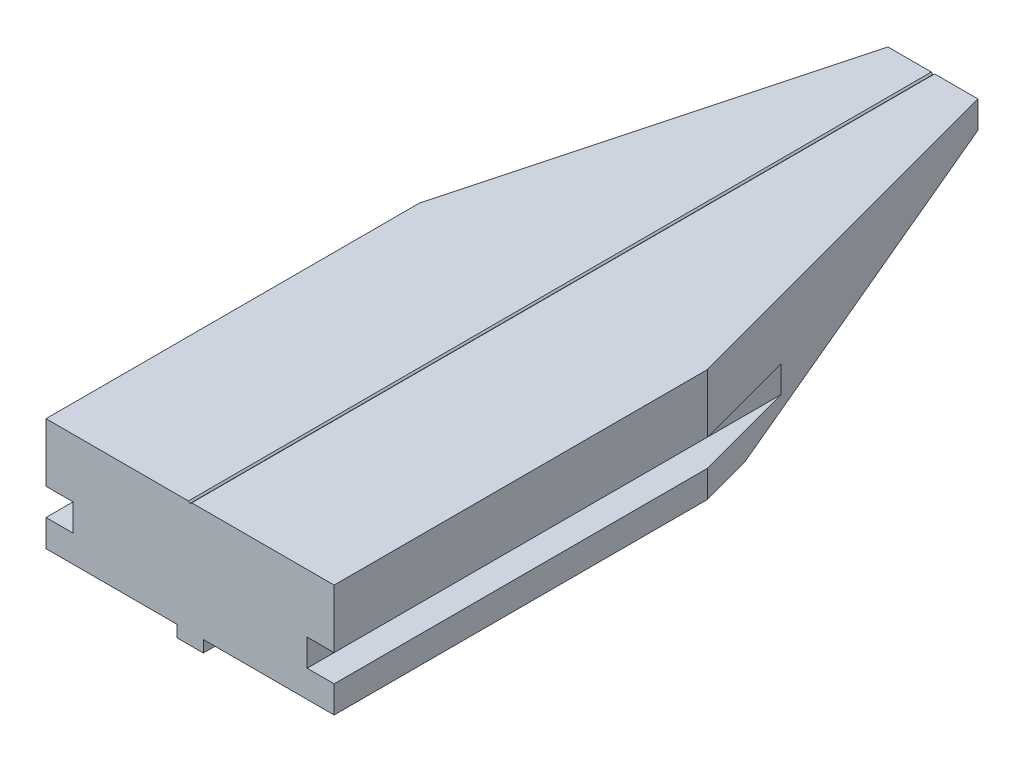
ISO-10303-21;
HEADER;
FILE_DESCRIPTION(('STEP AP214'),'2;1');
FILE_NAME('part.step','',(''),(''),'','','');
FILE_SCHEMA(('AUTOMOTIVE_DESIGN { 1 0 10303 214 1 1 1 1 }'));
ENDSEC;
DATA;
#1=APPLICATION_CONTEXT('core data for automotive mechanical design processes');
#2=APPLICATION_PROTOCOL_DEFINITION('international standard','automotive_design',2000,#1);
#3=PRODUCT_CONTEXT('',#1,'mechanical');
#4=PRODUCT('Part','Part','',(#3));
#5=PRODUCT_RELATED_PRODUCT_CATEGORY('part','',(#4));
#6=PRODUCT_DEFINITION_FORMATION('','',#4);
#7=PRODUCT_DEFINITION_CONTEXT('part definition',#1,'design');
#8=PRODUCT_DEFINITION('design','',#6,#7);
#9=PRODUCT_DEFINITION_SHAPE('','',#8);
#10=(LENGTH_UNIT() NAMED_UNIT(*) SI_UNIT(.MILLI.,.METRE.));
#11=(NAMED_UNIT(*) PLANE_ANGLE_UNIT() SI_UNIT($,.RADIAN.));
#12=(NAMED_UNIT(*) SI_UNIT($,.STERADIAN.) SOLID_ANGLE_UNIT());
#13=UNCERTAINTY_MEASURE_WITH_UNIT(LENGTH_MEASURE(1.E-05),#10,'distance_accuracy_value','');
#14=(GEOMETRIC_REPRESENTATION_CONTEXT(3) GLOBAL_UNCERTAINTY_ASSIGNED_CONTEXT((#13)) GLOBAL_UNIT_ASSIGNED_CONTEXT((#10,
#11,#12)) REPRESENTATION_CONTEXT('',''));
#15=CARTESIAN_POINT('',(0.,0.,0.));
#16=DIRECTION('',(0.,0.,1.));
#17=DIRECTION('',(1.,0.,0.));
#18=AXIS2_PLACEMENT_3D('',#15,#16,#17);
#19=CARTESIAN_POINT('',(-26.264291863592,5.72280367008093,8.06086224835195));
#20=DIRECTION('',(0.,1.,0.));
#21=DIRECTION('',(-1.,0.,0.));
#22=AXIS2_PLACEMENT_3D('',#19,#20,#21);
#23=PLANE('',#22);
#24=CARTESIAN_POINT('',(-17.764291863592,5.72280367008099,-21.9391377516482));
#25=DIRECTION('',(0.,-1.,0.));
#26=DIRECTION('',(0.,0.,-0.999999999999999));
#27=AXIS2_PLACEMENT_3D('',#24,#25,#26);
#28=CIRCLE('',#27,1.25);
#29=CARTESIAN_POINT('',(-17.764291863592,5.72280367008099,-23.1891377516482));
#30=VERTEX_POINT('',#29);
#31=EDGE_CURVE('E187',#30,#30,#28,.T.);
#32=ORIENTED_EDGE('',*,*,#31,.F.);
#33=EDGE_LOOP('',(#32));
#34=FACE_BOUND('',#33,.T.);
#35=DIRECTION('',(-0.258819045102521,0.,0.965925826289068));
#36=VECTOR('',#35,1.);
#37=CARTESIAN_POINT('',(-36.6261521427776,5.72280367008093,5.28441015445991));
#38=LINE('',#37,#36);
#39=CARTESIAN_POINT('',(-24.7642918635923,5.7228036700811,-38.9846550797427));
#40=VERTEX_POINT('',#39);
#41=CARTESIAN_POINT('',(-26.2642918635919,5.7228036700811,-33.3865788683904));
#42=VERTEX_POINT('',#41);
#43=EDGE_CURVE('E241',#40,#42,#38,.T.);
#44=ORIENTED_EDGE('',*,*,#43,.F.);
#45=DIRECTION('',(1.,0.,0.));
#46=VECTOR('',#45,1.);
#47=CARTESIAN_POINT('',(-26.2642918635929,5.72280367008099,-38.9846550797428));
#48=LINE('',#47,#46);
#49=CARTESIAN_POINT('',(-11.739291863592,5.72280367008098,-38.984655079743));
#50=VERTEX_POINT('',#49);
#51=EDGE_CURVE('E276',#40,#50,#48,.T.);
#52=ORIENTED_EDGE('',*,*,#51,.T.);
#53=DIRECTION('',(0.,0.,-0.999999999999999));
#54=VECTOR('',#53,1.);
#55=CARTESIAN_POINT('',(-11.739291863592,5.72280367008111,8.06086224835179));
#56=LINE('',#55,#54);
#57=CARTESIAN_POINT('',(-11.739291863592,5.72280367008111,8.06086224835179));
#58=VERTEX_POINT('',#57);
#59=EDGE_CURVE('E422',#58,#50,#56,.T.);
#60=ORIENTED_EDGE('',*,*,#59,.F.);
#61=DIRECTION('',(1.,0.,0.));
#62=VECTOR('',#61,1.);
#63=CARTESIAN_POINT('',(-26.264291863592,5.72280367008093,8.06086224835195));
#64=LINE('',#63,#62);
#65=CARTESIAN_POINT('',(-26.264291863592,5.72280367008093,8.06086224835195));
#66=VERTEX_POINT('',#65);
#67=EDGE_CURVE('E300',#66,#58,#64,.T.);
#68=ORIENTED_EDGE('',*,*,#67,.F.);
#69=DIRECTION('',(0.,0.,-0.999999999999999));
#70=VECTOR('',#69,1.);
#71=CARTESIAN_POINT('',(-26.264291863592,5.72280367008093,8.06086224835195));
#72=LINE('',#71,#70);
#73=EDGE_CURVE('E360',#66,#42,#72,.T.);
#74=ORIENTED_EDGE('',*,*,#73,.T.);
#75=EDGE_LOOP('',(#44,#52,#60,#68,#74));
#76=FACE_BOUND('',#75,.T.);
#77=ADVANCED_FACE('F16',(#34,#76),#23,.F.);
#78=CARTESIAN_POINT('',(-26.2642918635918,18.2228036700811,8.0608622483519));
#79=DIRECTION('',(0.,1.,0.));
#80=DIRECTION('',(-1.,0.,0.));
#81=AXIS2_PLACEMENT_3D('',#78,#79,#80);
#82=PLANE('',#81);
#83=DIRECTION('',(1.,0.,0.));
#84=VECTOR('',#83,1.);
#85=CARTESIAN_POINT('',(-26.2642918635919,18.2228036700809,-74.4391377516481));
#86=LINE('',#85,#84);
#87=CARTESIAN_POINT('',(-15.264291863592,18.2228036700811,-74.4391377516483));
#88=VERTEX_POINT('',#87);
#89=CARTESIAN_POINT('',(-10.4453578807699,18.2228036700811,-74.4391377516482));
#90=VERTEX_POINT('',#89);
#91=EDGE_CURVE('E305',#88,#90,#86,.T.);
#92=ORIENTED_EDGE('',*,*,#91,.F.);
#93=DIRECTION('',(-0.258819045102521,0.,0.965925826289068));
#94=VECTOR('',#93,1.);
#95=CARTESIAN_POINT('',(-15.264291863592,18.2228036700811,-74.4391377516483));
#96=LINE('',#95,#94);
#97=CARTESIAN_POINT('',(-26.2642918635919,18.2228036700811,-33.3865788683907));
#98=VERTEX_POINT('',#97);
#99=EDGE_CURVE('E232',#88,#98,#96,.T.);
#100=ORIENTED_EDGE('',*,*,#99,.T.);
#101=DIRECTION('',(0.,0.,-0.999999999999999));
#102=VECTOR('',#101,1.);
#103=CARTESIAN_POINT('',(-26.2642918635918,18.2228036700811,8.0608622483519));
#104=LINE('',#103,#102);
#105=CARTESIAN_POINT('',(-26.2642918635918,18.2228036700811,8.0608622483519));
#106=VERTEX_POINT('',#105);
#107=EDGE_CURVE('E382',#106,#98,#104,.T.);
#108=ORIENTED_EDGE('',*,*,#107,.F.);
#109=DIRECTION('',(1.,0.,0.));
#110=VECTOR('',#109,1.);
#111=CARTESIAN_POINT('',(-26.2642918635918,18.2228036700811,8.0608622483519));
#112=LINE('',#111,#110);
#113=CARTESIAN_POINT('',(-10.4453578807699,18.222803670081,8.06086224835173));
#114=VERTEX_POINT('',#113);
#115=EDGE_CURVE('E336',#106,#114,#112,.T.);
#116=ORIENTED_EDGE('',*,*,#115,.T.);
#117=DIRECTION('',(0.,0.,0.999999999999999));
#118=VECTOR('',#117,1.);
#119=CARTESIAN_POINT('',(-10.4453578807699,18.2228036700811,-74.4391377516482));
#120=LINE('',#119,#118);
#121=EDGE_CURVE('E293',#90,#114,#120,.T.);
#122=ORIENTED_EDGE('',*,*,#121,.F.);
#123=EDGE_LOOP('',(#92,#100,#108,#116,#122));
#124=FACE_BOUND('',#123,.T.);
#125=ADVANCED_FACE('F543',(#124),#82,.T.);
#126=CARTESIAN_POINT('',(-26.2642918635919,11.7228036700811,8.06086224835201));
#127=DIRECTION('',(-1.,0.,0.));
#128=DIRECTION('',(0.,-1.,0.));
#129=AXIS2_PLACEMENT_3D('',#126,#127,#128);
#130=PLANE('',#129);
#131=ORIENTED_EDGE('',*,*,#107,.T.);
#132=DIRECTION('',(0.,1.,0.));
#133=VECTOR('',#132,1.);
#134=CARTESIAN_POINT('',(-26.2642918635919,4.42280367008091,-33.3865788683906));
#135=LINE('',#134,#133);
#136=CARTESIAN_POINT('',(-26.264291863592,11.7228036700809,-33.3865788683906));
#137=VERTEX_POINT('',#136);
#138=EDGE_CURVE('E236',#137,#98,#135,.T.);
#139=ORIENTED_EDGE('',*,*,#138,.F.);
#140=DIRECTION('',(0.,0.,-0.999999999999999));
#141=VECTOR('',#140,1.);
#142=CARTESIAN_POINT('',(-26.2642918635919,11.7228036700811,8.06086224835201));
#143=LINE('',#142,#141);
#144=CARTESIAN_POINT('',(-26.2642918635919,11.7228036700811,8.06086224835201));
#145=VERTEX_POINT('',#144);
#146=EDGE_CURVE('E378',#145,#137,#143,.T.);
#147=ORIENTED_EDGE('',*,*,#146,.F.);
#148=DIRECTION('',(0.,1.,0.));
#149=VECTOR('',#148,1.);
#150=CARTESIAN_POINT('',(-26.2642918635919,11.7228036700811,8.06086224835201));
#151=LINE('',#150,#149);
#152=EDGE_CURVE('E340',#145,#106,#151,.T.);
#153=ORIENTED_EDGE('',*,*,#152,.T.);
#154=EDGE_LOOP('',(#131,#139,#147,#153));
#155=FACE_BOUND('',#154,.T.);
#156=ADVANCED_FACE('F538',(#155),#130,.T.);
#157=CARTESIAN_POINT('',(-23.264291863592,11.722803670081,8.06086224835201));
#158=DIRECTION('',(0.,-1.,0.));
#159=DIRECTION('',(1.,0.,0.));
#160=AXIS2_PLACEMENT_3D('',#157,#158,#159);
#161=PLANE('',#160);
#162=ORIENTED_EDGE('',*,*,#146,.T.);
#163=DIRECTION('',(0.258819045102521,0.,-0.965925826289068));
#164=VECTOR('',#163,1.);
#165=CARTESIAN_POINT('',(-36.4251902484542,11.722803670081,4.53441015445982));
#166=LINE('',#165,#164);
#167=CARTESIAN_POINT('',(-23.264291863592,11.7228036700812,-44.5827312910968));
#168=VERTEX_POINT('',#167);
#169=EDGE_CURVE('E255',#137,#168,#166,.T.);
#170=ORIENTED_EDGE('',*,*,#169,.T.);
#171=DIRECTION('',(0.,0.,-0.999999999999999));
#172=VECTOR('',#171,1.);
#173=CARTESIAN_POINT('',(-23.264291863592,11.722803670081,8.06086224835201));
#174=LINE('',#173,#172);
#175=CARTESIAN_POINT('',(-23.264291863592,11.722803670081,8.06086224835201));
#176=VERTEX_POINT('',#175);
#177=EDGE_CURVE('E374',#176,#168,#174,.T.);
#178=ORIENTED_EDGE('',*,*,#177,.F.);
#179=DIRECTION('',(-1.,0.,0.));
#180=VECTOR('',#179,1.);
#181=CARTESIAN_POINT('',(-23.264291863592,11.722803670081,8.06086224835201));
#182=LINE('',#181,#180);
#183=EDGE_CURVE('E344',#176,#145,#182,.T.);
#184=ORIENTED_EDGE('',*,*,#183,.T.);
#185=EDGE_LOOP('',(#162,#170,#178,#184));
#186=FACE_BOUND('',#185,.T.);
#187=ADVANCED_FACE('F536',(#186),#161,.T.);
#188=CARTESIAN_POINT('',(-23.264291863592,8.72280367008103,8.06086224835173));
#189=DIRECTION('',(-1.,0.,0.));
#190=DIRECTION('',(0.,-1.,0.));
#191=AXIS2_PLACEMENT_3D('',#188,#189,#190);
#192=PLANE('',#191);
#193=ORIENTED_EDGE('',*,*,#177,.T.);
#194=DIRECTION('',(0.,-1.,0.));
#195=VECTOR('',#194,1.);
#196=CARTESIAN_POINT('',(-23.2642918635919,8.72280367008248,-44.5827312910974));
#197=LINE('',#196,#195);
#198=CARTESIAN_POINT('',(-23.2642918635918,8.72280367008087,-44.5827312910972));
#199=VERTEX_POINT('',#198);
#200=EDGE_CURVE('E251',#168,#199,#197,.T.);
#201=ORIENTED_EDGE('',*,*,#200,.T.);
#202=DIRECTION('',(0.,0.,-0.999999999999999));
#203=VECTOR('',#202,1.);
#204=CARTESIAN_POINT('',(-23.264291863592,8.72280367008103,8.06086224835173));
#205=LINE('',#204,#203);
#206=CARTESIAN_POINT('',(-23.264291863592,8.72280367008103,8.06086224835173));
#207=VERTEX_POINT('',#206);
#208=EDGE_CURVE('E370',#207,#199,#205,.T.);
#209=ORIENTED_EDGE('',*,*,#208,.F.);
#210=DIRECTION('',(0.,1.,0.));
#211=VECTOR('',#210,1.);
#212=CARTESIAN_POINT('',(-23.264291863592,8.72280367008103,8.06086224835173));
#213=LINE('',#212,#211);
#214=EDGE_CURVE('E348',#207,#176,#213,.T.);
#215=ORIENTED_EDGE('',*,*,#214,.T.);
#216=EDGE_LOOP('',(#193,#201,#209,#215));
#217=FACE_BOUND('',#216,.T.);
#218=ADVANCED_FACE('F533',(#217),#192,.T.);
#219=CARTESIAN_POINT('',(-26.2642918635919,8.72280367008116,8.06086224835217));
#220=DIRECTION('',(0.,1.,0.));
#221=DIRECTION('',(0.,0.,0.999999999999999));
#222=AXIS2_PLACEMENT_3D('',#219,#220,#221);
#223=PLANE('',#222);
#224=ORIENTED_EDGE('',*,*,#208,.T.);
#225=DIRECTION('',(-0.258819045102521,0.,0.965925826289068));
#226=VECTOR('',#225,1.);
#227=CARTESIAN_POINT('',(-36.6261521427775,8.72280367008105,5.28441015445985));
#228=LINE('',#227,#226);
#229=CARTESIAN_POINT('',(-26.2642918635919,8.72280367008108,-33.3865788683904));
#230=VERTEX_POINT('',#229);
#231=EDGE_CURVE('E247',#199,#230,#228,.T.);
#232=ORIENTED_EDGE('',*,*,#231,.T.);
#233=DIRECTION('',(0.,0.,-0.999999999999999));
#234=VECTOR('',#233,1.);
#235=CARTESIAN_POINT('',(-26.2642918635919,8.72280367008116,8.06086224835217));
#236=LINE('',#235,#234);
#237=CARTESIAN_POINT('',(-26.2642918635919,8.72280367008116,8.06086224835217));
#238=VERTEX_POINT('',#237);
#239=EDGE_CURVE('E366',#238,#230,#236,.T.);
#240=ORIENTED_EDGE('',*,*,#239,.F.);
#241=DIRECTION('',(1.,0.,0.));
#242=VECTOR('',#241,1.);
#243=CARTESIAN_POINT('',(-26.2642918635919,8.72280367008116,8.06086224835217));
#244=LINE('',#243,#242);
#245=EDGE_CURVE('E352',#238,#207,#244,.T.);
#246=ORIENTED_EDGE('',*,*,#245,.T.);
#247=EDGE_LOOP('',(#224,#232,#240,#246));
#248=FACE_BOUND('',#247,.T.);
#249=ADVANCED_FACE('F522',(#248),#223,.T.);
#250=CARTESIAN_POINT('',(-26.264291863592,5.72280367008093,8.06086224835195));
#251=DIRECTION('',(-1.,0.,0.));
#252=DIRECTION('',(0.,-1.,0.));
#253=AXIS2_PLACEMENT_3D('',#250,#251,#252);
#254=PLANE('',#253);
#255=ORIENTED_EDGE('',*,*,#239,.T.);
#256=EDGE_CURVE('E242',#42,#230,#135,.T.);
#257=ORIENTED_EDGE('',*,*,#256,.F.);
#258=ORIENTED_EDGE('',*,*,#73,.F.);
#259=DIRECTION('',(0.,1.,0.));
#260=VECTOR('',#259,1.);
#261=CARTESIAN_POINT('',(-26.264291863592,5.72280367008093,8.06086224835195));
#262=LINE('',#261,#260);
#263=EDGE_CURVE('E356',#66,#238,#262,.T.);
#264=ORIENTED_EDGE('',*,*,#263,.T.);
#265=EDGE_LOOP('',(#255,#257,#258,#264));
#266=FACE_BOUND('',#265,.T.);
#267=ADVANCED_FACE('F524',(#266),#254,.T.);
#268=CARTESIAN_POINT('',(-11.739291863592,5.72280367008098,-74.4391377516482));
#269=DIRECTION('',(0.,0.,-0.999999999999999));
#270=DIRECTION('',(-1.,0.,0.));
#271=AXIS2_PLACEMENT_3D('',#268,#269,#270);
#272=PLANE('',#271);
#273=DIRECTION('',(0.,1.,0.));
#274=VECTOR('',#273,1.);
#275=CARTESIAN_POINT('',(-5.26429186359193,4.42280367008108,-74.4391377516481));
#276=LINE('',#275,#274);
#277=CARTESIAN_POINT('',(-5.26429186359188,15.2228036700809,-74.4391377516479));
#278=VERTEX_POINT('',#277);
#279=CARTESIAN_POINT('',(-5.26429186359189,18.2228036700812,-74.439137751648));
#280=VERTEX_POINT('',#279);
#281=EDGE_CURVE('E206',#278,#280,#276,.T.);
#282=ORIENTED_EDGE('',*,*,#281,.F.);
#283=DIRECTION('',(-1.,0.,0.));
#284=VECTOR('',#283,1.);
#285=CARTESIAN_POINT('',(5.73570813640818,15.2228036700809,-74.4391377516482));
#286=LINE('',#285,#284);
#287=CARTESIAN_POINT('',(-15.2642918635919,15.2228036700811,-74.439137751648));
#288=VERTEX_POINT('',#287);
#289=EDGE_CURVE('E259',#278,#288,#286,.T.);
#290=ORIENTED_EDGE('',*,*,#289,.T.);
#291=DIRECTION('',(0.,1.,0.));
#292=VECTOR('',#291,1.);
#293=CARTESIAN_POINT('',(-15.2642918635918,4.42280367008119,-74.4391377516483));
#294=LINE('',#293,#292);
#295=EDGE_CURVE('E237',#288,#88,#294,.T.);
#296=ORIENTED_EDGE('',*,*,#295,.T.);
#297=ORIENTED_EDGE('',*,*,#91,.T.);
#298=DIRECTION('',(0.707106781186555,-0.707106781186538,0.));
#299=VECTOR('',#298,1.);
#300=CARTESIAN_POINT('',(-10.4453578807699,18.2228036700811,-74.4391377516482));
#301=LINE('',#300,#299);
#302=CARTESIAN_POINT('',(-10.2855050670275,18.0629508563387,-74.4391377516479));
#303=VERTEX_POINT('',#302);
#304=EDGE_CURVE('E280',#90,#303,#301,.T.);
#305=ORIENTED_EDGE('',*,*,#304,.T.);
#306=CARTESIAN_POINT('',(-10.2642918635919,18.0841640597743,-74.439137751648));
#307=DIRECTION('',(0.,0.,-0.999999999999999));
#308=DIRECTION('',(-1.,0.,0.));
#309=AXIS2_PLACEMENT_3D('',#306,#307,#308);
#310=CIRCLE('',#309,0.03);
#311=CARTESIAN_POINT('',(-10.2430786601564,18.0629508563387,-74.4391377516481));
#312=VERTEX_POINT('',#311);
#313=EDGE_CURVE('E11',#303,#312,#310,.F.);
#314=ORIENTED_EDGE('',*,*,#313,.T.);
#315=DIRECTION('',(-0.707106781186557,-0.707106781186541,0.));
#316=VECTOR('',#315,1.);
#317=CARTESIAN_POINT('',(-10.083225846414,18.2228036700809,-74.4391377516479));
#318=LINE('',#317,#316);
#319=CARTESIAN_POINT('',(-10.083225846414,18.2228036700809,-74.4391377516479));
#320=VERTEX_POINT('',#319);
#321=EDGE_CURVE('E283',#320,#312,#318,.T.);
#322=ORIENTED_EDGE('',*,*,#321,.F.);
#323=EDGE_CURVE('E296',#320,#280,#86,.T.);
#324=ORIENTED_EDGE('',*,*,#323,.T.);
#325=EDGE_LOOP('',(#282,#290,#296,#297,#305,#314,#322,#324));
#326=FACE_BOUND('',#325,.T.);
#327=ADVANCED_FACE('F548',(#326),#272,.T.);
#328=CARTESIAN_POINT('',(5.73570813640801,1.19460200142596,-22.0851763854044));
#329=DIRECTION('',(0.,0.965925826289071,0.258819045102514));
#330=DIRECTION('',(0.,-0.258819045102514,0.96592582628907));
#331=AXIS2_PLACEMENT_3D('',#328,#329,#330);
#332=PLANE('',#331);
#333=ORIENTED_EDGE('',*,*,#289,.F.);
#334=DIRECTION('',(0.250562807085733,-0.250562807085726,0.93511312653103));
#335=VECTOR('',#334,1.);
#336=CARTESIAN_POINT('',(8.57379409490585,1.38471771158366,-22.794697875029));
#337=LINE('',#336,#335);
#338=CARTESIAN_POINT('',(4.23570813640816,5.72280367008106,-38.9846550797435));
#339=VERTEX_POINT('',#338);
#340=EDGE_CURVE('E228',#278,#339,#337,.T.);
#341=ORIENTED_EDGE('',*,*,#340,.T.);
#342=DIRECTION('',(-1.,0.,0.));
#343=VECTOR('',#342,1.);
#344=CARTESIAN_POINT('',(5.73570813640708,5.72280367008116,-38.9846550797436));
#345=LINE('',#344,#343);
#346=CARTESIAN_POINT('',(-8.78929186359201,5.72280367008089,-38.984655079743));
#347=VERTEX_POINT('',#346);
#348=EDGE_CURVE('E262',#339,#347,#345,.T.);
#349=ORIENTED_EDGE('',*,*,#348,.T.);
#350=DIRECTION('',(0.,-0.258819045102515,0.96592582628907));
#351=VECTOR('',#350,1.);
#352=CARTESIAN_POINT('',(-8.78929186359215,-6.03857566194232,4.90941015446039));
#353=LINE('',#352,#351);
#354=CARTESIAN_POINT('',(-8.78929186359192,4.42280367008115,-34.1329890299036));
#355=VERTEX_POINT('',#354);
#356=EDGE_CURVE('E265',#347,#355,#353,.T.);
#357=ORIENTED_EDGE('',*,*,#356,.T.);
#358=DIRECTION('',(1.,0.,0.));
#359=VECTOR('',#358,1.);
#360=CARTESIAN_POINT('',(-11.739291863593,4.42280367008106,-34.1329890299033));
#361=LINE('',#360,#359);
#362=CARTESIAN_POINT('',(-11.739291863592,4.42280367008106,-34.1329890299036));
#363=VERTEX_POINT('',#362);
#364=EDGE_CURVE('E268',#363,#355,#361,.T.);
#365=ORIENTED_EDGE('',*,*,#364,.F.);
#366=DIRECTION('',(0.,-0.258819045102514,0.96592582628907));
#367=VECTOR('',#366,1.);
#368=CARTESIAN_POINT('',(-11.739291863592,-6.03857566194234,4.90941015446034));
#369=LINE('',#368,#367);
#370=EDGE_CURVE('E272',#50,#363,#369,.T.);
#371=ORIENTED_EDGE('',*,*,#370,.F.);
#372=ORIENTED_EDGE('',*,*,#51,.F.);
#373=DIRECTION('',(-0.250562807085733,-0.250562807085724,0.935113126531031));
#374=VECTOR('',#373,1.);
#375=CARTESIAN_POINT('',(-27.09336277266,3.3937327610135,-30.2924441126713));
#376=LINE('',#375,#374);
#377=EDGE_CURVE('E426',#288,#40,#376,.T.);
#378=ORIENTED_EDGE('',*,*,#377,.F.);
#379=EDGE_LOOP('',(#333,#341,#349,#357,#365,#371,#372,#378));
#380=FACE_BOUND('',#379,.T.);
#381=ADVANCED_FACE('F551',(#380),#332,.F.);
#382=DIRECTION('',(0.258819045102521,0.,0.965925826289068));
#383=VECTOR('',#382,1.);
#384=CARTESIAN_POINT('',(-5.26429186359189,18.2228036700812,-74.439137751648));
#385=LINE('',#384,#383);
#386=CARTESIAN_POINT('',(5.73570813640802,18.222803670081,-33.3865788683906));
#387=VERTEX_POINT('',#386);
#388=EDGE_CURVE('E203',#280,#387,#385,.T.);
#389=ORIENTED_EDGE('',*,*,#388,.F.);
#390=ORIENTED_EDGE('',*,*,#323,.F.);
#391=DIRECTION('',(0.,0.,0.999999999999999));
#392=VECTOR('',#391,1.);
#393=CARTESIAN_POINT('',(-10.083225846414,18.2228036700809,-74.4391377516479));
#394=LINE('',#393,#392);
#395=CARTESIAN_POINT('',(-10.0832258464139,18.2228036700811,8.06086224835173));
#396=VERTEX_POINT('',#395);
#397=EDGE_CURVE('E288',#320,#396,#394,.T.);
#398=ORIENTED_EDGE('',*,*,#397,.T.);
#399=CARTESIAN_POINT('',(5.73570813640799,18.2228036700812,8.06086224835195));
#400=VERTEX_POINT('',#399);
#401=EDGE_CURVE('E335',#396,#400,#112,.T.);
#402=ORIENTED_EDGE('',*,*,#401,.T.);
#403=DIRECTION('',(0.,0.,-0.999999999999999));
#404=VECTOR('',#403,1.);
#405=CARTESIAN_POINT('',(5.73570813640799,18.2228036700812,8.06086224835195));
#406=LINE('',#405,#404);
#407=EDGE_CURVE('E386',#400,#387,#406,.T.);
#408=ORIENTED_EDGE('',*,*,#407,.T.);
#409=EDGE_LOOP('',(#389,#390,#398,#402,#408));
#410=FACE_BOUND('',#409,.T.);
#411=ADVANCED_FACE('F594',(#410),#82,.T.);
#412=CARTESIAN_POINT('',(-11.739291863592,5.72280367008111,8.06086224835179));
#413=DIRECTION('',(1.,0.,0.));
#414=DIRECTION('',(0.,0.,-0.999999999999999));
#415=AXIS2_PLACEMENT_3D('',#412,#413,#414);
#416=PLANE('',#415);
#417=ORIENTED_EDGE('',*,*,#59,.T.);
#418=ORIENTED_EDGE('',*,*,#370,.T.);
#419=DIRECTION('',(0.,0.,-0.999999999999999));
#420=VECTOR('',#419,1.);
#421=CARTESIAN_POINT('',(-11.7392918635919,4.42280367008109,8.06086224835206));
#422=LINE('',#421,#420);
#423=CARTESIAN_POINT('',(-11.7392918635919,4.42280367008109,8.06086224835206));
#424=VERTEX_POINT('',#423);
#425=EDGE_CURVE('E418',#424,#363,#422,.T.);
#426=ORIENTED_EDGE('',*,*,#425,.F.);
#427=DIRECTION('',(0.,-1.,0.));
#428=VECTOR('',#427,1.);
#429=CARTESIAN_POINT('',(-11.739291863592,5.72280367008111,8.06086224835179));
#430=LINE('',#429,#428);
#431=EDGE_CURVE('E304',#58,#424,#430,.T.);
#432=ORIENTED_EDGE('',*,*,#431,.F.);
#433=EDGE_LOOP('',(#417,#418,#426,#432));
#434=FACE_BOUND('',#433,.T.);
#435=ADVANCED_FACE('F557',(#434),#416,.F.);
#436=CARTESIAN_POINT('',(-11.7392918635919,4.42280367008109,8.06086224835206));
#437=DIRECTION('',(0.,1.,0.));
#438=DIRECTION('',(-1.,0.,0.));
#439=AXIS2_PLACEMENT_3D('',#436,#437,#438);
#440=PLANE('',#439);
#441=ORIENTED_EDGE('',*,*,#425,.T.);
#442=ORIENTED_EDGE('',*,*,#364,.T.);
#443=DIRECTION('',(0.,0.,-0.999999999999999));
#444=VECTOR('',#443,1.);
#445=CARTESIAN_POINT('',(-8.78929186359192,4.4228036700812,8.06086224835184));
#446=LINE('',#445,#444);
#447=CARTESIAN_POINT('',(-8.78929186359192,4.4228036700812,8.06086224835184));
#448=VERTEX_POINT('',#447);
#449=EDGE_CURVE('E414',#448,#355,#446,.T.);
#450=ORIENTED_EDGE('',*,*,#449,.F.);
#451=DIRECTION('',(1.,0.,0.));
#452=VECTOR('',#451,1.);
#453=CARTESIAN_POINT('',(-11.7392918635919,4.42280367008109,8.06086224835206));
#454=LINE('',#453,#452);
#455=EDGE_CURVE('E308',#424,#448,#454,.T.);
#456=ORIENTED_EDGE('',*,*,#455,.F.);
#457=EDGE_LOOP('',(#441,#442,#450,#456));
#458=FACE_BOUND('',#457,.T.);
#459=ADVANCED_FACE('F564',(#458),#440,.F.);
#460=CARTESIAN_POINT('',(-8.78929186359182,5.72280367008121,8.0608622483519));
#461=DIRECTION('',(1.,0.,0.));
#462=DIRECTION('',(0.,1.,0.));
#463=AXIS2_PLACEMENT_3D('',#460,#461,#462);
#464=PLANE('',#463);
#465=ORIENTED_EDGE('',*,*,#356,.F.);
#466=DIRECTION('',(0.,0.,-0.999999999999999));
#467=VECTOR('',#466,1.);
#468=CARTESIAN_POINT('',(-8.78929186359182,5.72280367008121,8.0608622483519));
#469=LINE('',#468,#467);
#470=CARTESIAN_POINT('',(-8.78929186359182,5.72280367008121,8.0608622483519));
#471=VERTEX_POINT('',#470);
#472=EDGE_CURVE('E410',#471,#347,#469,.T.);
#473=ORIENTED_EDGE('',*,*,#472,.F.);
#474=DIRECTION('',(0.,-1.,0.));
#475=VECTOR('',#474,1.);
#476=CARTESIAN_POINT('',(-8.78929186359182,5.72280367008121,8.0608622483519));
#477=LINE('',#476,#475);
#478=EDGE_CURVE('E311',#471,#448,#477,.T.);
#479=ORIENTED_EDGE('',*,*,#478,.T.);
#480=ORIENTED_EDGE('',*,*,#449,.T.);
#481=EDGE_LOOP('',(#465,#473,#479,#480));
#482=FACE_BOUND('',#481,.T.);
#483=ADVANCED_FACE('F567',(#482),#464,.T.);
#484=CARTESIAN_POINT('',(5.73570813640809,5.72280367008116,8.06086224835206));
#485=DIRECTION('',(0.,-1.,0.));
#486=DIRECTION('',(1.,0.,0.));
#487=AXIS2_PLACEMENT_3D('',#484,#485,#486);
#488=PLANE('',#487);
#489=CARTESIAN_POINT('',(-2.76429186359193,5.72280367008111,-21.939137751648));
#490=DIRECTION('',(0.,-1.,0.));
#491=DIRECTION('',(0.,0.,-0.999999999999999));
#492=AXIS2_PLACEMENT_3D('',#489,#490,#491);
#493=CIRCLE('',#492,1.25);
#494=CARTESIAN_POINT('',(-2.76429186359193,5.72280367008111,-23.189137751648));
#495=VERTEX_POINT('',#494);
#496=EDGE_CURVE('E188',#495,#495,#493,.T.);
#497=ORIENTED_EDGE('',*,*,#496,.F.);
#498=EDGE_LOOP('',(#497));
#499=FACE_BOUND('',#498,.T.);
#500=DIRECTION('',(-0.258819045102521,0.,-0.965925826289068));
#501=VECTOR('',#500,1.);
#502=CARTESIAN_POINT('',(16.0975684155937,5.72280367008106,5.28441015446018));
#503=LINE('',#502,#501);
#504=CARTESIAN_POINT('',(5.73570813640805,5.72280367008104,-33.3865788683904));
#505=VERTEX_POINT('',#504);
#506=EDGE_CURVE('E225',#505,#339,#503,.T.);
#507=ORIENTED_EDGE('',*,*,#506,.F.);
#508=DIRECTION('',(0.,0.,-0.999999999999999));
#509=VECTOR('',#508,1.);
#510=CARTESIAN_POINT('',(5.73570813640809,5.72280367008116,8.06086224835206));
#511=LINE('',#510,#509);
#512=CARTESIAN_POINT('',(5.73570813640809,5.72280367008116,8.06086224835206));
#513=VERTEX_POINT('',#512);
#514=EDGE_CURVE('E406',#513,#505,#511,.T.);
#515=ORIENTED_EDGE('',*,*,#514,.F.);
#516=DIRECTION('',(-1.,0.,0.));
#517=VECTOR('',#516,1.);
#518=CARTESIAN_POINT('',(5.73570813640809,5.72280367008116,8.06086224835206));
#519=LINE('',#518,#517);
#520=EDGE_CURVE('E315',#513,#471,#519,.T.);
#521=ORIENTED_EDGE('',*,*,#520,.T.);
#522=ORIENTED_EDGE('',*,*,#472,.T.);
#523=ORIENTED_EDGE('',*,*,#348,.F.);
#524=EDGE_LOOP('',(#507,#515,#521,#522,#523));
#525=FACE_BOUND('',#524,.T.);
#526=ADVANCED_FACE('F570',(#499,#525),#488,.T.);
#527=CARTESIAN_POINT('',(5.73570813640809,5.72280367008116,8.06086224835206));
#528=DIRECTION('',(-1.,0.,0.));
#529=DIRECTION('',(0.,-1.,0.));
#530=AXIS2_PLACEMENT_3D('',#527,#528,#529);
#531=PLANE('',#530);
#532=ORIENTED_EDGE('',*,*,#514,.T.);
#533=DIRECTION('',(0.,1.,0.));
#534=VECTOR('',#533,1.);
#535=CARTESIAN_POINT('',(5.73570813640812,4.42280367008108,-33.3865788683907));
#536=LINE('',#535,#534);
#537=CARTESIAN_POINT('',(5.73570813640811,8.72280367008121,-33.3865788683908));
#538=VERTEX_POINT('',#537);
#539=EDGE_CURVE('E209',#505,#538,#536,.T.);
#540=ORIENTED_EDGE('',*,*,#539,.T.);
#541=DIRECTION('',(0.,0.,-0.999999999999999));
#542=VECTOR('',#541,1.);
#543=CARTESIAN_POINT('',(5.73570813640806,8.72280367008092,8.06086224835195));
#544=LINE('',#543,#542);
#545=CARTESIAN_POINT('',(5.73570813640806,8.72280367008092,8.06086224835195));
#546=VERTEX_POINT('',#545);
#547=EDGE_CURVE('E402',#546,#538,#544,.T.);
#548=ORIENTED_EDGE('',*,*,#547,.F.);
#549=DIRECTION('',(0.,1.,0.));
#550=VECTOR('',#549,1.);
#551=CARTESIAN_POINT('',(5.73570813640809,5.72280367008116,8.06086224835206));
#552=LINE('',#551,#550);
#553=EDGE_CURVE('E319',#513,#546,#552,.T.);
#554=ORIENTED_EDGE('',*,*,#553,.F.);
#555=EDGE_LOOP('',(#532,#540,#548,#554));
#556=FACE_BOUND('',#555,.T.);
#557=ADVANCED_FACE('F576',(#556),#531,.F.);
#558=CARTESIAN_POINT('',(5.73570813640806,8.72280367008092,8.06086224835195));
#559=DIRECTION('',(0.,-1.,0.));
#560=DIRECTION('',(1.,0.,0.));
#561=AXIS2_PLACEMENT_3D('',#558,#559,#560);
#562=PLANE('',#561);
#563=ORIENTED_EDGE('',*,*,#547,.T.);
#564=DIRECTION('',(-0.258819045102521,0.,-0.965925826289069));
#565=VECTOR('',#564,1.);
#566=CARTESIAN_POINT('',(16.0975684155937,8.72280367008116,5.28441015445996));
#567=LINE('',#566,#565);
#568=CARTESIAN_POINT('',(2.73570813640812,8.7228036700811,-44.5827312910972));
#569=VERTEX_POINT('',#568);
#570=EDGE_CURVE('E221',#538,#569,#567,.T.);
#571=ORIENTED_EDGE('',*,*,#570,.T.);
#572=DIRECTION('',(0.,0.,-0.999999999999999));
#573=VECTOR('',#572,1.);
#574=CARTESIAN_POINT('',(2.73570813640793,8.72280367008099,8.06086224835201));
#575=LINE('',#574,#573);
#576=CARTESIAN_POINT('',(2.73570813640793,8.72280367008099,8.06086224835201));
#577=VERTEX_POINT('',#576);
#578=EDGE_CURVE('E398',#577,#569,#575,.T.);
#579=ORIENTED_EDGE('',*,*,#578,.F.);
#580=DIRECTION('',(-1.,0.,0.));
#581=VECTOR('',#580,1.);
#582=CARTESIAN_POINT('',(5.73570813640806,8.72280367008092,8.06086224835195));
#583=LINE('',#582,#581);
#584=EDGE_CURVE('E322',#546,#577,#583,.T.);
#585=ORIENTED_EDGE('',*,*,#584,.F.);
#586=EDGE_LOOP('',(#563,#571,#579,#585));
#587=FACE_BOUND('',#586,.T.);
#588=ADVANCED_FACE('F578',(#587),#562,.F.);
#589=CARTESIAN_POINT('',(2.73570813640793,8.72280367008099,8.06086224835201));
#590=DIRECTION('',(-1.,0.,0.));
#591=DIRECTION('',(0.,0.,0.999999999999999));
#592=AXIS2_PLACEMENT_3D('',#589,#590,#591);
#593=PLANE('',#592);
#594=ORIENTED_EDGE('',*,*,#578,.T.);
#595=DIRECTION('',(0.,1.,0.));
#596=VECTOR('',#595,1.);
#597=CARTESIAN_POINT('',(2.73570813640812,8.7228036700811,-44.5827312910972));
#598=LINE('',#597,#596);
#599=CARTESIAN_POINT('',(2.73570813640802,11.7228036700811,-44.582731291097));
#600=VERTEX_POINT('',#599);
#601=EDGE_CURVE('E217',#569,#600,#598,.T.);
#602=ORIENTED_EDGE('',*,*,#601,.T.);
#603=DIRECTION('',(0.,0.,-0.999999999999999));
#604=VECTOR('',#603,1.);
#605=CARTESIAN_POINT('',(2.73570813640804,11.722803670081,8.06086224835184));
#606=LINE('',#605,#604);
#607=CARTESIAN_POINT('',(2.73570813640804,11.722803670081,8.06086224835184));
#608=VERTEX_POINT('',#607);
#609=EDGE_CURVE('E394',#608,#600,#606,.T.);
#610=ORIENTED_EDGE('',*,*,#609,.F.);
#611=DIRECTION('',(0.,1.,0.));
#612=VECTOR('',#611,1.);
#613=CARTESIAN_POINT('',(2.73570813640793,8.72280367008099,8.06086224835201));
#614=LINE('',#613,#612);
#615=EDGE_CURVE('E325',#577,#608,#614,.T.);
#616=ORIENTED_EDGE('',*,*,#615,.F.);
#617=EDGE_LOOP('',(#594,#602,#610,#616));
#618=FACE_BOUND('',#617,.T.);
#619=ADVANCED_FACE('F582',(#618),#593,.F.);
#620=CARTESIAN_POINT('',(2.73570813640804,11.722803670081,8.06086224835184));
#621=DIRECTION('',(0.,1.,0.));
#622=DIRECTION('',(-1.,0.,0.));
#623=AXIS2_PLACEMENT_3D('',#620,#621,#622);
#624=PLANE('',#623);
#625=ORIENTED_EDGE('',*,*,#609,.T.);
#626=DIRECTION('',(0.258819045102522,0.,0.965925826289068));
#627=VECTOR('',#626,1.);
#628=CARTESIAN_POINT('',(15.8966065212704,11.7228036700811,4.53441015445966));
#629=LINE('',#628,#627);
#630=CARTESIAN_POINT('',(5.73570813640806,11.7228036700811,-33.3865788683907));
#631=VERTEX_POINT('',#630);
#632=EDGE_CURVE('E213',#600,#631,#629,.T.);
#633=ORIENTED_EDGE('',*,*,#632,.T.);
#634=DIRECTION('',(0.,0.,-0.999999999999999));
#635=VECTOR('',#634,1.);
#636=CARTESIAN_POINT('',(5.73570813640814,11.7228036700812,8.06086224835168));
#637=LINE('',#636,#635);
#638=CARTESIAN_POINT('',(5.73570813640814,11.7228036700812,8.06086224835168));
#639=VERTEX_POINT('',#638);
#640=EDGE_CURVE('E390',#639,#631,#637,.T.);
#641=ORIENTED_EDGE('',*,*,#640,.F.);
#642=DIRECTION('',(1.,0.,0.));
#643=VECTOR('',#642,1.);
#644=CARTESIAN_POINT('',(2.73570813640804,11.722803670081,8.06086224835184));
#645=LINE('',#644,#643);
#646=EDGE_CURVE('E328',#608,#639,#645,.T.);
#647=ORIENTED_EDGE('',*,*,#646,.F.);
#648=EDGE_LOOP('',(#625,#633,#641,#647));
#649=FACE_BOUND('',#648,.T.);
#650=ADVANCED_FACE('F589',(#649),#624,.F.);
#651=CARTESIAN_POINT('',(5.73570813640814,11.7228036700812,8.06086224835168));
#652=DIRECTION('',(-1.,0.,0.));
#653=DIRECTION('',(0.,-1.,0.));
#654=AXIS2_PLACEMENT_3D('',#651,#652,#653);
#655=PLANE('',#654);
#656=ORIENTED_EDGE('',*,*,#640,.T.);
#657=DIRECTION('',(0.,1.,0.));
#658=VECTOR('',#657,1.);
#659=CARTESIAN_POINT('',(5.73570813640806,11.7228036700811,-33.3865788683907));
#660=LINE('',#659,#658);
#661=EDGE_CURVE('E429',#631,#387,#660,.T.);
#662=ORIENTED_EDGE('',*,*,#661,.T.);
#663=ORIENTED_EDGE('',*,*,#407,.F.);
#664=DIRECTION('',(0.,1.,0.));
#665=VECTOR('',#664,1.);
#666=CARTESIAN_POINT('',(5.73570813640814,11.7228036700812,8.06086224835168));
#667=LINE('',#666,#665);
#668=EDGE_CURVE('E331',#639,#400,#667,.T.);
#669=ORIENTED_EDGE('',*,*,#668,.F.);
#670=EDGE_LOOP('',(#656,#662,#663,#669));
#671=FACE_BOUND('',#670,.T.);
#672=ADVANCED_FACE('F591',(#671),#655,.F.);
#673=CARTESIAN_POINT('',(-11.739291863592,5.72280367008111,8.06086224835179));
#674=DIRECTION('',(0.,0.,-0.999999999999999));
#675=DIRECTION('',(-1.,0.,0.));
#676=AXIS2_PLACEMENT_3D('',#673,#674,#675);
#677=PLANE('',#676);
#678=DIRECTION('',(-0.707106781186557,-0.707106781186541,0.));
#679=VECTOR('',#678,1.);
#680=CARTESIAN_POINT('',(-10.0832258464139,18.2228036700811,8.06086224835173));
#681=LINE('',#680,#679);
#682=CARTESIAN_POINT('',(-10.2430786601564,18.0629508563386,8.06086224835156));
#683=VERTEX_POINT('',#682);
#684=EDGE_CURVE('E284',#396,#683,#681,.T.);
#685=ORIENTED_EDGE('',*,*,#684,.T.);
#686=CARTESIAN_POINT('',(-10.2642918635919,18.0841640597743,8.0608622483519));
#687=DIRECTION('',(0.,0.,-0.999999999999999));
#688=DIRECTION('',(-1.,0.,0.));
#689=AXIS2_PLACEMENT_3D('',#686,#687,#688);
#690=CIRCLE('',#689,0.03);
#691=CARTESIAN_POINT('',(-10.2855050670275,18.0629508563387,8.0608622483519));
#692=VERTEX_POINT('',#691);
#693=EDGE_CURVE('E25',#683,#692,#690,.T.);
#694=ORIENTED_EDGE('',*,*,#693,.T.);
#695=DIRECTION('',(0.707106781186555,-0.707106781186538,0.));
#696=VECTOR('',#695,1.);
#697=CARTESIAN_POINT('',(-10.4453578807699,18.222803670081,8.06086224835173));
#698=LINE('',#697,#696);
#699=EDGE_CURVE('E279',#114,#692,#698,.T.);
#700=ORIENTED_EDGE('',*,*,#699,.F.);
#701=ORIENTED_EDGE('',*,*,#115,.F.);
#702=ORIENTED_EDGE('',*,*,#152,.F.);
#703=ORIENTED_EDGE('',*,*,#183,.F.);
#704=ORIENTED_EDGE('',*,*,#214,.F.);
#705=ORIENTED_EDGE('',*,*,#245,.F.);
#706=ORIENTED_EDGE('',*,*,#263,.F.);
#707=ORIENTED_EDGE('',*,*,#67,.T.);
#708=ORIENTED_EDGE('',*,*,#431,.T.);
#709=ORIENTED_EDGE('',*,*,#455,.T.);
#710=ORIENTED_EDGE('',*,*,#478,.F.);
#711=ORIENTED_EDGE('',*,*,#520,.F.);
#712=ORIENTED_EDGE('',*,*,#553,.T.);
#713=ORIENTED_EDGE('',*,*,#584,.T.);
#714=ORIENTED_EDGE('',*,*,#615,.T.);
#715=ORIENTED_EDGE('',*,*,#646,.T.);
#716=ORIENTED_EDGE('',*,*,#668,.T.);
#717=ORIENTED_EDGE('',*,*,#401,.F.);
#718=EDGE_LOOP('',(#685,#694,#700,#701,#702,#703,#704,#705,#706,#707,#708,#709,#710,#711,#712,
#713,#714,#715,#716,#717));
#719=FACE_BOUND('',#718,.T.);
#720=ADVANCED_FACE('F527',(#719),#677,.F.);
#721=CARTESIAN_POINT('',(-10.4453578807699,18.2228036700811,-74.4391377516482));
#722=DIRECTION('',(-0.70710678118654,-0.707106781186556,0.));
#723=DIRECTION('',(0.707106781186555,-0.707106781186538,0.));
#724=AXIS2_PLACEMENT_3D('',#721,#722,#723);
#725=PLANE('',#724);
#726=ORIENTED_EDGE('',*,*,#699,.T.);
#727=DIRECTION('',(0.,0.,0.999999999999999));
#728=VECTOR('',#727,1.);
#729=CARTESIAN_POINT('',(-10.2855050670275,18.0629508563387,-74.4391377516479));
#730=LINE('',#729,#728);
#731=EDGE_CURVE('E32',#692,#303,#730,.F.);
#732=ORIENTED_EDGE('',*,*,#731,.T.);
#733=ORIENTED_EDGE('',*,*,#304,.F.);
#734=ORIENTED_EDGE('',*,*,#121,.T.);
#735=EDGE_LOOP('',(#726,#732,#733,#734));
#736=FACE_BOUND('',#735,.T.);
#737=ADVANCED_FACE('F602',(#736),#725,.F.);
#738=CARTESIAN_POINT('',(-10.083225846414,18.2228036700809,-74.4391377516479));
#739=DIRECTION('',(-0.707106781186539,0.707106781186555,0.));
#740=DIRECTION('',(-0.707106781186556,-0.707106781186541,0.));
#741=AXIS2_PLACEMENT_3D('',#738,#739,#740);
#742=PLANE('',#741);
#743=ORIENTED_EDGE('',*,*,#321,.T.);
#744=DIRECTION('',(0.,0.,0.999999999999999));
#745=VECTOR('',#744,1.);
#746=CARTESIAN_POINT('',(-10.2430786601564,18.0629508563387,-74.4391377516481));
#747=LINE('',#746,#745);
#748=EDGE_CURVE('E433',#312,#683,#747,.T.);
#749=ORIENTED_EDGE('',*,*,#748,.T.);
#750=ORIENTED_EDGE('',*,*,#684,.F.);
#751=ORIENTED_EDGE('',*,*,#397,.F.);
#752=EDGE_LOOP('',(#743,#749,#750,#751));
#753=FACE_BOUND('',#752,.T.);
#754=ADVANCED_FACE('F597',(#753),#742,.T.);
#755=CARTESIAN_POINT('',(-15.2642918635918,4.42280367008119,-74.4391377516483));
#756=DIRECTION('',(-0.965925826289068,0.,-0.258819045102521));
#757=DIRECTION('',(-0.258819045102521,0.,0.965925826289068));
#758=AXIS2_PLACEMENT_3D('',#755,#756,#757);
#759=PLANE('',#758);
#760=ORIENTED_EDGE('',*,*,#138,.T.);
#761=ORIENTED_EDGE('',*,*,#99,.F.);
#762=ORIENTED_EDGE('',*,*,#295,.F.);
#763=ORIENTED_EDGE('',*,*,#377,.T.);
#764=ORIENTED_EDGE('',*,*,#43,.T.);
#765=ORIENTED_EDGE('',*,*,#256,.T.);
#766=ORIENTED_EDGE('',*,*,#231,.F.);
#767=ORIENTED_EDGE('',*,*,#200,.F.);
#768=ORIENTED_EDGE('',*,*,#169,.F.);
#769=EDGE_LOOP('',(#760,#761,#762,#763,#764,#765,#766,#767,#768));
#770=FACE_BOUND('',#769,.T.);
#771=ADVANCED_FACE('F518',(#770),#759,.T.);
#772=CARTESIAN_POINT('',(-5.26429186359193,4.42280367008108,-74.4391377516481));
#773=DIRECTION('',(-0.965925826289068,0.,0.258819045102521));
#774=DIRECTION('',(0.258819045102521,0.,0.965925826289068));
#775=AXIS2_PLACEMENT_3D('',#772,#773,#774);
#776=PLANE('',#775);
#777=ORIENTED_EDGE('',*,*,#281,.T.);
#778=ORIENTED_EDGE('',*,*,#388,.T.);
#779=ORIENTED_EDGE('',*,*,#661,.F.);
#780=ORIENTED_EDGE('',*,*,#632,.F.);
#781=ORIENTED_EDGE('',*,*,#601,.F.);
#782=ORIENTED_EDGE('',*,*,#570,.F.);
#783=ORIENTED_EDGE('',*,*,#539,.F.);
#784=ORIENTED_EDGE('',*,*,#506,.T.);
#785=ORIENTED_EDGE('',*,*,#340,.F.);
#786=EDGE_LOOP('',(#777,#778,#779,#780,#781,#782,#783,#784,#785));
#787=FACE_BOUND('',#786,.T.);
#788=ADVANCED_FACE('F660',(#787),#776,.F.);
#789=CARTESIAN_POINT('',(-17.7642918635919,11.7228036700813,-21.9391377516479));
#790=DIRECTION('',(0.,-1.,0.));
#791=DIRECTION('',(0.,0.,-0.999999999999999));
#792=AXIS2_PLACEMENT_3D('',#789,#790,#791);
#793=CONICAL_SURFACE('',#792,1.25,1.02974425867665);
#794=CARTESIAN_POINT('',(-17.764291863592,12.4738794438656,-21.9391377516483));
#795=VERTEX_POINT('',#794);
#796=VERTEX_LOOP('',#795);
#797=FACE_BOUND('',#796,.T.);
#798=CARTESIAN_POINT('',(-17.7642918635919,11.7228036700813,-21.9391377516479));
#799=DIRECTION('',(0.,-1.,0.));
#800=DIRECTION('',(0.,0.,-0.999999999999999));
#801=AXIS2_PLACEMENT_3D('',#798,#799,#800);
#802=CIRCLE('',#801,1.25);
#803=CARTESIAN_POINT('',(-17.7642918635919,11.7228036700813,-23.1891377516478));
#804=VERTEX_POINT('',#803);
#805=EDGE_CURVE('E195',#804,#804,#802,.T.);
#806=ORIENTED_EDGE('',*,*,#805,.T.);
#807=EDGE_LOOP('',(#806));
#808=FACE_BOUND('',#807,.T.);
#809=ADVANCED_FACE('F663',(#797,#808),#793,.F.);
#810=CARTESIAN_POINT('',(-17.764291863592,5.72280367008099,-21.9391377516482));
#811=DIRECTION('',(0.,-1.,0.));
#812=DIRECTION('',(0.,0.,-0.999999999999999));
#813=AXIS2_PLACEMENT_3D('',#810,#811,#812);
#814=CYLINDRICAL_SURFACE('',#813,1.25);
#815=ORIENTED_EDGE('',*,*,#805,.F.);
#816=EDGE_LOOP('',(#815));
#817=FACE_BOUND('',#816,.T.);
#818=ORIENTED_EDGE('',*,*,#31,.T.);
#819=EDGE_LOOP('',(#818));
#820=FACE_BOUND('',#819,.T.);
#821=ADVANCED_FACE('F180',(#817,#820),#814,.F.);
#822=CARTESIAN_POINT('',(-2.764291863592,11.722803670081,-21.9391377516483));
#823=DIRECTION('',(0.,-1.,0.));
#824=DIRECTION('',(0.,0.,-0.999999999999999));
#825=AXIS2_PLACEMENT_3D('',#822,#823,#824);
#826=CONICAL_SURFACE('',#825,1.25,1.02974425867665);
#827=CARTESIAN_POINT('',(-2.76429186359203,12.4738794438655,-21.9391377516484));
#828=VERTEX_POINT('',#827);
#829=VERTEX_LOOP('',#828);
#830=FACE_BOUND('',#829,.T.);
#831=CARTESIAN_POINT('',(-2.764291863592,11.722803670081,-21.9391377516483));
#832=DIRECTION('',(0.,-1.,0.));
#833=DIRECTION('',(0.,0.,-0.999999999999999));
#834=AXIS2_PLACEMENT_3D('',#831,#832,#833);
#835=CIRCLE('',#834,1.25);
#836=CARTESIAN_POINT('',(-2.764291863592,11.722803670081,-23.1891377516483));
#837=VERTEX_POINT('',#836);
#838=EDGE_CURVE('E184',#837,#837,#835,.T.);
#839=ORIENTED_EDGE('',*,*,#838,.T.);
#840=EDGE_LOOP('',(#839));
#841=FACE_BOUND('',#840,.T.);
#842=ADVANCED_FACE('F176',(#830,#841),#826,.F.);
#843=CARTESIAN_POINT('',(-2.76429186359193,5.72280367008111,-21.939137751648));
#844=DIRECTION('',(0.,-1.,0.));
#845=DIRECTION('',(0.,0.,-0.999999999999999));
#846=AXIS2_PLACEMENT_3D('',#843,#844,#845);
#847=CYLINDRICAL_SURFACE('',#846,1.25);
#848=ORIENTED_EDGE('',*,*,#838,.F.);
#849=EDGE_LOOP('',(#848));
#850=FACE_BOUND('',#849,.T.);
#851=ORIENTED_EDGE('',*,*,#496,.T.);
#852=EDGE_LOOP('',(#851));
#853=FACE_BOUND('',#852,.T.);
#854=ADVANCED_FACE('F179',(#850,#853),#847,.F.);
#855=CARTESIAN_POINT('',(-10.2642918635919,18.0841640597743,-74.439137751648));
#856=DIRECTION('',(0.,0.,0.999999999999999));
#857=DIRECTION('',(1.,0.,0.));
#858=AXIS2_PLACEMENT_3D('',#855,#856,#857);
#859=CYLINDRICAL_SURFACE('',#858,0.03);
#860=ORIENTED_EDGE('',*,*,#313,.F.);
#861=ORIENTED_EDGE('',*,*,#731,.F.);
#862=ORIENTED_EDGE('',*,*,#693,.F.);
#863=ORIENTED_EDGE('',*,*,#748,.F.);
#864=EDGE_LOOP('',(#860,#861,#862,#863));
#865=FACE_BOUND('',#864,.T.);
#866=ADVANCED_FACE('F18',(#865),#859,.F.);
#867=CLOSED_SHELL('',(#77,#125,#156,#187,#218,#249,#267,#327,#381,#411,#435,#459,#483,#526,#557,
#588,#619,#650,#672,#720,#737,#754,#771,#788,#809,#821,#842,#854,#866));
#868=MANIFOLD_SOLID_BREP('B1',#867);
#869=ADVANCED_BREP_SHAPE_REPRESENTATION('',(#18,#868),#14);
#870=SHAPE_DEFINITION_REPRESENTATION(#9,#869);
ENDSEC;
END-ISO-10303-21;
